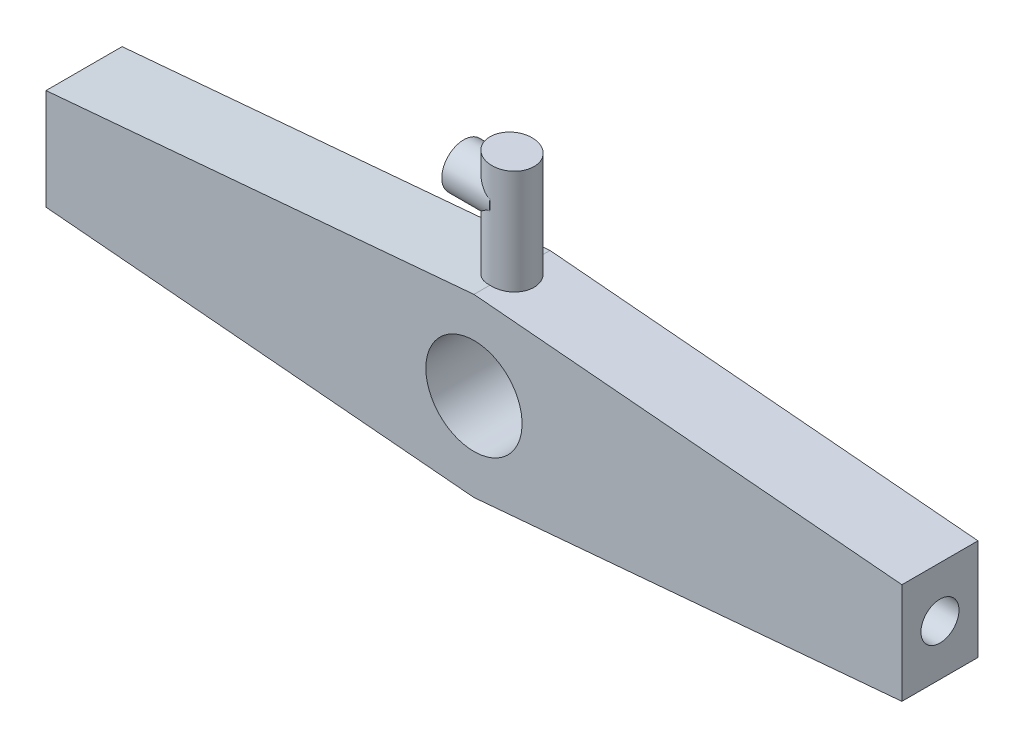
ISO-10303-21;
HEADER;
FILE_DESCRIPTION(('STEP AP214'),'2;1');
FILE_NAME('part.step','',(''),(''),'','','');
FILE_SCHEMA(('AUTOMOTIVE_DESIGN { 1 0 10303 214 1 1 1 1 }'));
ENDSEC;
DATA;
#1=APPLICATION_CONTEXT('core data for automotive mechanical design processes');
#2=APPLICATION_PROTOCOL_DEFINITION('international standard','automotive_design',2000,#1);
#3=PRODUCT_CONTEXT('',#1,'mechanical');
#4=PRODUCT('Part','Part','',(#3));
#5=PRODUCT_RELATED_PRODUCT_CATEGORY('part','',(#4));
#6=PRODUCT_DEFINITION_FORMATION('','',#4);
#7=PRODUCT_DEFINITION_CONTEXT('part definition',#1,'design');
#8=PRODUCT_DEFINITION('design','',#6,#7);
#9=PRODUCT_DEFINITION_SHAPE('','',#8);
#10=(LENGTH_UNIT() NAMED_UNIT(*) SI_UNIT(.MILLI.,.METRE.));
#11=(NAMED_UNIT(*) PLANE_ANGLE_UNIT() SI_UNIT($,.RADIAN.));
#12=(NAMED_UNIT(*) SI_UNIT($,.STERADIAN.) SOLID_ANGLE_UNIT());
#13=UNCERTAINTY_MEASURE_WITH_UNIT(LENGTH_MEASURE(1.E-05),#10,'distance_accuracy_value','');
#14=(GEOMETRIC_REPRESENTATION_CONTEXT(3) GLOBAL_UNCERTAINTY_ASSIGNED_CONTEXT((#13)) GLOBAL_UNIT_ASSIGNED_CONTEXT((#10,
#11,#12)) REPRESENTATION_CONTEXT('',''));
#15=CARTESIAN_POINT('',(0.,0.,0.));
#16=DIRECTION('',(0.,0.,1.));
#17=DIRECTION('',(1.,0.,0.));
#18=AXIS2_PLACEMENT_3D('',#15,#16,#17);
#19=CARTESIAN_POINT('',(0.,-23.4932723213508,20.32));
#20=DIRECTION('',(-0.0871557427476577,0.996194698091746,0.));
#21=DIRECTION('',(-0.996194698091746,-0.0871557427476577,0.));
#22=AXIS2_PLACEMENT_3D('',#19,#20,#21);
#23=PLANE('',#22);
#24=DIRECTION('',(0.,0.,-1.));
#25=VECTOR('',#24,1.);
#26=CARTESIAN_POINT('',(114.3,-13.4933180803377,20.32));
#27=LINE('',#26,#25);
#28=CARTESIAN_POINT('',(114.3,-13.4933180803377,20.32));
#29=VERTEX_POINT('',#28);
#30=CARTESIAN_POINT('',(114.3,-13.4933180803377,0.));
#31=VERTEX_POINT('',#30);
#32=EDGE_CURVE('E53',#29,#31,#27,.T.);
#33=ORIENTED_EDGE('',*,*,#32,.F.);
#34=DIRECTION('',(0.996194698091746,0.0871557427476577,0.));
#35=VECTOR('',#34,1.);
#36=CARTESIAN_POINT('',(0.,-23.4932723213508,20.32));
#37=LINE('',#36,#35);
#38=CARTESIAN_POINT('',(0.,-23.4932723213508,20.32));
#39=VERTEX_POINT('',#38);
#40=EDGE_CURVE('E233',#39,#29,#37,.T.);
#41=ORIENTED_EDGE('',*,*,#40,.F.);
#42=DIRECTION('',(0.,0.,-1.));
#43=VECTOR('',#42,1.);
#44=CARTESIAN_POINT('',(0.,-23.4932723213508,20.32));
#45=LINE('',#44,#43);
#46=CARTESIAN_POINT('',(0.,-23.4932723213508,0.));
#47=VERTEX_POINT('',#46);
#48=EDGE_CURVE('E137',#39,#47,#45,.T.);
#49=ORIENTED_EDGE('',*,*,#48,.T.);
#50=DIRECTION('',(0.996194698091746,0.0871557427476577,0.));
#51=VECTOR('',#50,1.);
#52=CARTESIAN_POINT('',(0.,-23.4932723213508,0.));
#53=LINE('',#52,#51);
#54=EDGE_CURVE('E123',#47,#31,#53,.T.);
#55=ORIENTED_EDGE('',*,*,#54,.T.);
#56=EDGE_LOOP('',(#33,#41,#49,#55));
#57=FACE_BOUND('',#56,.T.);
#58=ADVANCED_FACE('F39',(#57),#23,.F.);
#59=CARTESIAN_POINT('',(152.4,10.1600000000002,20.32));
#60=DIRECTION('',(-0.0871557427476576,-0.996194698091746,0.));
#61=DIRECTION('',(0.996194698091746,-0.0871557427476576,0.));
#62=AXIS2_PLACEMENT_3D('',#59,#60,#61);
#63=PLANE('',#62);
#64=DIRECTION('',(0.,0.,1.));
#65=VECTOR('',#64,1.);
#66=CARTESIAN_POINT('',(114.3,13.4933180803379,20.32));
#67=LINE('',#66,#65);
#68=CARTESIAN_POINT('',(114.3,13.4933180803379,0.));
#69=VERTEX_POINT('',#68);
#70=CARTESIAN_POINT('',(114.3,13.4933180803379,20.32));
#71=VERTEX_POINT('',#70);
#72=EDGE_CURVE('E200',#69,#71,#67,.T.);
#73=ORIENTED_EDGE('',*,*,#72,.F.);
#74=DIRECTION('',(-0.996194698091746,0.0871557427476576,0.));
#75=VECTOR('',#74,1.);
#76=CARTESIAN_POINT('',(152.4,10.1600000000002,0.));
#77=LINE('',#76,#75);
#78=CARTESIAN_POINT('',(0.,23.4932723213509,0.));
#79=VERTEX_POINT('',#78);
#80=EDGE_CURVE('E126',#69,#79,#77,.T.);
#81=ORIENTED_EDGE('',*,*,#80,.T.);
#82=DIRECTION('',(0.,0.,-1.));
#83=VECTOR('',#82,1.);
#84=CARTESIAN_POINT('',(0.,23.4932723213509,20.32));
#85=LINE('',#84,#83);
#86=CARTESIAN_POINT('',(0.,23.4932723213509,4.27700993086949));
#87=VERTEX_POINT('',#86);
#88=EDGE_CURVE('E138',#87,#79,#85,.T.);
#89=ORIENTED_EDGE('',*,*,#88,.F.);
#90=CARTESIAN_POINT('',(0.,23.4932723213509,10.16));
#91=DIRECTION('',(-0.0871557427476576,-0.996194698091746,0.));
#92=DIRECTION('',(-0.996194698091746,0.0871557427476576,0.));
#93=AXIS2_PLACEMENT_3D('',#90,#91,#92);
#94=ELLIPSE('',#93,5.90546213546372,5.88299006913051);
#95=CARTESIAN_POINT('',(0.,23.4932723213509,16.0429900691305));
#96=VERTEX_POINT('',#95);
#97=EDGE_CURVE('E140',#96,#87,#94,.F.);
#98=ORIENTED_EDGE('',*,*,#97,.F.);
#99=CARTESIAN_POINT('',(0.,23.4932723213509,20.32));
#100=VERTEX_POINT('',#99);
#101=EDGE_CURVE('E134',#100,#96,#85,.T.);
#102=ORIENTED_EDGE('',*,*,#101,.F.);
#103=DIRECTION('',(-0.996194698091746,0.0871557427476576,0.));
#104=VECTOR('',#103,1.);
#105=CARTESIAN_POINT('',(152.4,10.1600000000002,20.32));
#106=LINE('',#105,#104);
#107=EDGE_CURVE('E202',#71,#100,#106,.T.);
#108=ORIENTED_EDGE('',*,*,#107,.F.);
#109=EDGE_LOOP('',(#73,#81,#89,#98,#102,#108));
#110=FACE_BOUND('',#109,.T.);
#111=ADVANCED_FACE('F172',(#110),#63,.F.);
#112=CARTESIAN_POINT('',(0.,0.,20.32));
#113=DIRECTION('',(0.,0.,1.));
#114=DIRECTION('',(1.,0.,0.));
#115=AXIS2_PLACEMENT_3D('',#112,#113,#114);
#116=PLANE('',#115);
#117=CARTESIAN_POINT('',(0.,0.,20.32));
#118=DIRECTION('',(0.,0.,-1.));
#119=DIRECTION('',(-1.,0.,0.));
#120=AXIS2_PLACEMENT_3D('',#117,#118,#119);
#121=CIRCLE('',#120,12.85);
#122=CARTESIAN_POINT('',(-12.85,0.,20.32));
#123=VERTEX_POINT('',#122);
#124=EDGE_CURVE('E211',#123,#123,#121,.T.);
#125=ORIENTED_EDGE('',*,*,#124,.T.);
#126=EDGE_LOOP('',(#125));
#127=FACE_BOUND('',#126,.T.);
#128=ORIENTED_EDGE('',*,*,#40,.T.);
#129=DIRECTION('',(0.,1.,0.));
#130=VECTOR('',#129,1.);
#131=CARTESIAN_POINT('',(114.3,0.,20.32));
#132=LINE('',#131,#130);
#133=EDGE_CURVE('E204',#29,#71,#132,.T.);
#134=ORIENTED_EDGE('',*,*,#133,.T.);
#135=ORIENTED_EDGE('',*,*,#107,.T.);
#136=DIRECTION('',(-0.996194698091745,-0.0871557427476594,0.));
#137=VECTOR('',#136,1.);
#138=CARTESIAN_POINT('',(0.,23.4932723213509,20.32));
#139=LINE('',#138,#137);
#140=CARTESIAN_POINT('',(-114.3,13.4933180803377,20.32));
#141=VERTEX_POINT('',#140);
#142=EDGE_CURVE('E133',#100,#141,#139,.T.);
#143=ORIENTED_EDGE('',*,*,#142,.T.);
#144=DIRECTION('',(0.,1.,0.));
#145=VECTOR('',#144,1.);
#146=CARTESIAN_POINT('',(-114.3,0.,20.32));
#147=LINE('',#146,#145);
#148=CARTESIAN_POINT('',(-114.3,-13.4933180803378,20.32));
#149=VERTEX_POINT('',#148);
#150=EDGE_CURVE('E109',#149,#141,#147,.T.);
#151=ORIENTED_EDGE('',*,*,#150,.F.);
#152=DIRECTION('',(0.996194698091746,-0.0871557427476576,0.));
#153=VECTOR('',#152,1.);
#154=CARTESIAN_POINT('',(-152.4,-10.1600000000001,20.32));
#155=LINE('',#154,#153);
#156=EDGE_CURVE('E118',#149,#39,#155,.T.);
#157=ORIENTED_EDGE('',*,*,#156,.T.);
#158=EDGE_LOOP('',(#128,#134,#135,#143,#151,#157));
#159=FACE_BOUND('',#158,.T.);
#160=ADVANCED_FACE('F179',(#127,#159),#116,.T.);
#161=CARTESIAN_POINT('',(0.,0.,0.));
#162=DIRECTION('',(0.,0.,1.));
#163=DIRECTION('',(1.,0.,0.));
#164=AXIS2_PLACEMENT_3D('',#161,#162,#163);
#165=PLANE('',#164);
#166=CARTESIAN_POINT('',(0.,0.,0.));
#167=DIRECTION('',(0.,0.,-1.));
#168=DIRECTION('',(-1.,0.,0.));
#169=AXIS2_PLACEMENT_3D('',#166,#167,#168);
#170=CIRCLE('',#169,12.85);
#171=CARTESIAN_POINT('',(-12.85,0.,0.));
#172=VERTEX_POINT('',#171);
#173=EDGE_CURVE('E206',#172,#172,#170,.T.);
#174=ORIENTED_EDGE('',*,*,#173,.F.);
#175=EDGE_LOOP('',(#174));
#176=FACE_BOUND('',#175,.T.);
#177=DIRECTION('',(0.,1.,0.));
#178=VECTOR('',#177,1.);
#179=CARTESIAN_POINT('',(114.3,0.,0.));
#180=LINE('',#179,#178);
#181=EDGE_CURVE('E11',#31,#69,#180,.T.);
#182=ORIENTED_EDGE('',*,*,#181,.F.);
#183=ORIENTED_EDGE('',*,*,#54,.F.);
#184=DIRECTION('',(0.996194698091746,-0.0871557427476576,0.));
#185=VECTOR('',#184,1.);
#186=CARTESIAN_POINT('',(-152.4,-10.1600000000001,0.));
#187=LINE('',#186,#185);
#188=CARTESIAN_POINT('',(-114.3,-13.4933180803378,0.));
#189=VERTEX_POINT('',#188);
#190=EDGE_CURVE('E116',#189,#47,#187,.T.);
#191=ORIENTED_EDGE('',*,*,#190,.F.);
#192=DIRECTION('',(0.,-1.,0.));
#193=VECTOR('',#192,1.);
#194=CARTESIAN_POINT('',(-114.3,0.,0.));
#195=LINE('',#194,#193);
#196=CARTESIAN_POINT('',(-114.3,13.4933180803377,0.));
#197=VERTEX_POINT('',#196);
#198=EDGE_CURVE('E100',#197,#189,#195,.T.);
#199=ORIENTED_EDGE('',*,*,#198,.F.);
#200=DIRECTION('',(-0.996194698091745,-0.0871557427476594,0.));
#201=VECTOR('',#200,1.);
#202=CARTESIAN_POINT('',(0.,23.4932723213509,0.));
#203=LINE('',#202,#201);
#204=EDGE_CURVE('E124',#79,#197,#203,.T.);
#205=ORIENTED_EDGE('',*,*,#204,.F.);
#206=ORIENTED_EDGE('',*,*,#80,.F.);
#207=EDGE_LOOP('',(#182,#183,#191,#199,#205,#206));
#208=FACE_BOUND('',#207,.T.);
#209=ADVANCED_FACE('F121',(#176,#208),#165,.F.);
#210=CARTESIAN_POINT('',(0.,23.4932723213509,20.32));
#211=DIRECTION('',(0.0871557427476594,-0.996194698091745,0.));
#212=DIRECTION('',(0.996194698091746,0.0871557427476594,0.));
#213=AXIS2_PLACEMENT_3D('',#210,#211,#212);
#214=PLANE('',#213);
#215=ORIENTED_EDGE('',*,*,#204,.T.);
#216=DIRECTION('',(0.,0.,1.));
#217=VECTOR('',#216,1.);
#218=CARTESIAN_POINT('',(-114.3,13.4933180803377,20.32));
#219=LINE('',#218,#217);
#220=EDGE_CURVE('E61',#197,#141,#219,.T.);
#221=ORIENTED_EDGE('',*,*,#220,.T.);
#222=ORIENTED_EDGE('',*,*,#142,.F.);
#223=ORIENTED_EDGE('',*,*,#101,.T.);
#224=CARTESIAN_POINT('',(0.,23.4932723213509,10.16));
#225=DIRECTION('',(0.0871557427476594,-0.996194698091745,0.));
#226=DIRECTION('',(0.996194698091745,0.0871557427476594,0.));
#227=AXIS2_PLACEMENT_3D('',#224,#225,#226);
#228=ELLIPSE('',#227,5.90546213546372,5.88299006913051);
#229=EDGE_CURVE('E128',#87,#96,#228,.F.);
#230=ORIENTED_EDGE('',*,*,#229,.F.);
#231=ORIENTED_EDGE('',*,*,#88,.T.);
#232=EDGE_LOOP('',(#215,#221,#222,#223,#230,#231));
#233=FACE_BOUND('',#232,.T.);
#234=ADVANCED_FACE('F41',(#233),#214,.F.);
#235=CARTESIAN_POINT('',(-152.4,-10.1600000000001,20.32));
#236=DIRECTION('',(0.0871557427476576,0.996194698091746,0.));
#237=DIRECTION('',(-0.996194698091746,0.0871557427476576,0.));
#238=AXIS2_PLACEMENT_3D('',#235,#236,#237);
#239=PLANE('',#238);
#240=ORIENTED_EDGE('',*,*,#156,.F.);
#241=DIRECTION('',(0.,0.,-1.));
#242=VECTOR('',#241,1.);
#243=CARTESIAN_POINT('',(-114.3,-13.4933180803378,20.32));
#244=LINE('',#243,#242);
#245=EDGE_CURVE('E103',#149,#189,#244,.T.);
#246=ORIENTED_EDGE('',*,*,#245,.T.);
#247=ORIENTED_EDGE('',*,*,#190,.T.);
#248=ORIENTED_EDGE('',*,*,#48,.F.);
#249=EDGE_LOOP('',(#240,#246,#247,#248));
#250=FACE_BOUND('',#249,.T.);
#251=ADVANCED_FACE('F114',(#250),#239,.F.);
#252=CARTESIAN_POINT('',(0.,15.3585773828179,10.16));
#253=DIRECTION('',(0.,1.,0.));
#254=DIRECTION('',(0.,0.,1.));
#255=AXIS2_PLACEMENT_3D('',#252,#253,#254);
#256=CYLINDRICAL_SURFACE('',#255,5.88299006913051);
#257=DIRECTION('',(0.,1.,0.));
#258=VECTOR('',#257,1.);
#259=CARTESIAN_POINT('',(0.,15.3585773828179,16.0429900691305));
#260=LINE('',#259,#258);
#261=CARTESIAN_POINT('',(0.,43.4667345390869,16.0429900691305));
#262=VERTEX_POINT('',#261);
#263=CARTESIAN_POINT('',(0.,40.5969888718145,16.0429900691305));
#264=VERTEX_POINT('',#263);
#265=EDGE_CURVE('E143',#262,#264,#260,.F.);
#266=ORIENTED_EDGE('',*,*,#265,.T.);
#267=CARTESIAN_POINT('',(0.,40.5969888718145,16.0429900691305));
#268=CARTESIAN_POINT('',(-0.0507233716180359,40.5970423621136,16.0429968325928));
#269=CARTESIAN_POINT('',(-0.101391923464873,40.5943730206743,16.0423339817998));
#270=CARTESIAN_POINT('',(-0.202031503958911,40.584052004848,16.0397331403268));
#271=CARTESIAN_POINT('',(-0.252004225975632,40.5764160371644,16.0377991692981));
#272=CARTESIAN_POINT('',(-0.398452063028152,40.5471274660646,16.0302837291207));
#273=CARTESIAN_POINT('',(-0.493564026932945,40.5190555631602,16.0229829456634));
#274=CARTESIAN_POINT('',(-0.663952634257977,40.4563351286083,16.0059301905964));
#275=CARTESIAN_POINT('',(-0.739980994383311,40.423438347139,15.9967514146317));
#276=CARTESIAN_POINT('',(-0.888886875985811,40.3517350256114,15.9759340289191));
#277=CARTESIAN_POINT('',(-0.961761783974112,40.3129236997932,15.9642934241951));
#278=CARTESIAN_POINT('',(-1.1781250031672,40.1895376152284,15.9257025476162));
#279=CARTESIAN_POINT('',(-1.31743962289615,40.0988264371081,15.8952884993961));
#280=CARTESIAN_POINT('',(-1.61589828195137,39.8909991335202,15.8192100741218));
#281=CARTESIAN_POINT('',(-1.77337824863868,39.772246387878,15.7717073700156));
#282=CARTESIAN_POINT('',(-2.08107432425158,39.5304204295999,15.6650135439132));
#283=CARTESIAN_POINT('',(-2.23128372927519,39.407343403588,15.6058118810668));
#284=CARTESIAN_POINT('',(-2.52521504409887,39.1606577800189,15.475879827428));
#285=CARTESIAN_POINT('',(-2.66895690815311,39.0370523214614,15.4051885197508));
#286=CARTESIAN_POINT('',(-2.95088134310323,38.790999225875,15.2519148788382));
#287=CARTESIAN_POINT('',(-3.08906596557627,38.6685511745746,15.1693369863206));
#288=CARTESIAN_POINT('',(-3.36304889577832,38.4234324185181,14.9897949138531));
#289=CARTESIAN_POINT('',(-3.49871240984866,38.3008256028067,14.892535435426));
#290=CARTESIAN_POINT('',(-3.76355922260491,38.0599455563261,14.6847697534928));
#291=CARTESIAN_POINT('',(-3.89274117658643,37.9416732261768,14.5742608171599));
#292=CARTESIAN_POINT('',(-4.26909474414113,37.5957747640874,14.222301482823));
#293=CARTESIAN_POINT('',(-4.50556223266685,37.3766248529639,13.9601056434007));
#294=CARTESIAN_POINT('',(-4.87697182359837,37.0322664308457,13.4603713132613));
#295=CARTESIAN_POINT('',(-5.02179407459334,36.8979430481215,13.2365161467421));
#296=CARTESIAN_POINT('',(-5.21842880289069,36.7162373433147,12.8795652443417));
#297=CARTESIAN_POINT('',(-5.28052903452697,36.6589759171929,12.7570832977667));
#298=CARTESIAN_POINT('',(-5.39704526195014,36.5519250122942,12.505354942969));
#299=CARTESIAN_POINT('',(-5.4514624988198,36.5021343266395,12.3761096319093));
#300=CARTESIAN_POINT('',(-5.5437313319438,36.4182289519886,12.1325064820594));
#301=CARTESIAN_POINT('',(-5.58284116078685,36.3828805340577,12.0190483500804));
#302=CARTESIAN_POINT('',(-5.65445578167218,36.31869385012,11.7882781393238));
#303=CARTESIAN_POINT('',(-5.68696183376217,36.28985434205,11.6709668007373));
#304=CARTESIAN_POINT('',(-5.74488310333297,36.2391913951261,11.4331326863397));
#305=CARTESIAN_POINT('',(-5.77029942511326,36.2173668635358,11.3126104138725));
#306=CARTESIAN_POINT('',(-5.81362788908437,36.181164048808,11.0691646945259));
#307=CARTESIAN_POINT('',(-5.83154303312915,36.1667827864456,10.9462422288178));
#308=CARTESIAN_POINT('',(-5.85964023794123,36.1457269963405,10.698341700248));
#309=CARTESIAN_POINT('',(-5.86979025973268,36.1390843399136,10.5733572714882));
#310=CARTESIAN_POINT('',(-5.88207357675243,36.1337892785626,10.3228241085184));
#311=CARTESIAN_POINT('',(-5.88420686092181,36.1351368846609,10.1972753735301));
#312=CARTESIAN_POINT('',(-5.88045565225516,36.145837494593,9.94664348849559));
#313=CARTESIAN_POINT('',(-5.87457127770124,36.1551903803265,9.8215603316082));
#314=CARTESIAN_POINT('',(-5.85494677887039,36.1817539077916,9.57286159257143));
#315=CARTESIAN_POINT('',(-5.84120682212943,36.198964381943,9.44924597918115));
#316=CARTESIAN_POINT('',(-5.80724505484495,36.2396725784171,9.21186445278678));
#317=CARTESIAN_POINT('',(-5.78746937874391,36.2627231342368,9.09795743511897));
#318=CARTESIAN_POINT('',(-5.74161431571017,36.31515792811,8.8728899947917));
#319=CARTESIAN_POINT('',(-5.71553256498495,36.3445445407466,8.76173061933127));
#320=CARTESIAN_POINT('',(-5.6284133467418,36.4416472596434,8.43322762255529));
#321=CARTESIAN_POINT('',(-5.55848632094275,36.5183247725582,8.22075384634682));
#322=CARTESIAN_POINT('',(-5.424232467805,36.6642012527176,7.87752329355235));
#323=CARTESIAN_POINT('',(-5.36519802334014,36.7280223943787,7.7422693827547));
#324=CARTESIAN_POINT('',(-5.23906217055595,36.8639472931535,7.47989241406409));
#325=CARTESIAN_POINT('',(-5.17195835454813,36.9360535220327,7.35277180035319));
#326=CARTESIAN_POINT('',(-4.96014036436632,37.1633091320018,6.98400780582283));
#327=CARTESIAN_POINT('',(-4.80491865143198,37.3293965135329,6.7549598113393));
#328=CARTESIAN_POINT('',(-4.52726103873885,37.6269343111416,6.39873588871943));
#329=CARTESIAN_POINT('',(-4.41008807695949,37.7526122753949,6.26232170365273));
#330=CARTESIAN_POINT('',(-4.16839818734098,38.0125991937273,6.00486127420554));
#331=CARTESIAN_POINT('',(-4.04387744721653,38.1469126314879,5.8838231119627));
#332=CARTESIAN_POINT('',(-3.78867504197607,38.4236024410842,5.65611929953271));
#333=CARTESIAN_POINT('',(-3.6579620173619,38.566020804557,5.54954046367934));
#334=CARTESIAN_POINT('',(-3.39285822117496,38.857274243272,5.35110591644349));
#335=CARTESIAN_POINT('',(-3.2584700985819,39.0061047390251,5.25923991143736));
#336=CARTESIAN_POINT('',(-2.98270618407666,39.315613569992,5.08649103118043));
#337=CARTESIAN_POINT('',(-2.84125715951128,39.4765268661524,5.00614817644085));
#338=CARTESIAN_POINT('',(-2.55847156975472,39.8057912126942,4.86008609349229));
#339=CARTESIAN_POINT('',(-2.41713617317662,39.9741598793104,4.7944039889226));
#340=CARTESIAN_POINT('',(-2.2096492674901,40.2325790640803,4.70723855729539));
#341=CARTESIAN_POINT('',(-2.14157677549741,40.3192381982198,4.68018635067822));
#342=CARTESIAN_POINT('',(-2.00767402380585,40.4952945367165,4.6297270707836));
#343=CARTESIAN_POINT('',(-1.94184313854377,40.5846909637319,4.60631897392521));
#344=CARTESIAN_POINT('',(-1.81420353146993,40.7666320495026,4.56332667660167));
#345=CARTESIAN_POINT('',(-1.75237898401396,40.8591618031699,4.54372673056773));
#346=CARTESIAN_POINT('',(-1.63506621611166,41.0488239579763,4.50846497637913));
#347=CARTESIAN_POINT('',(-1.57956803640884,41.145948774438,4.49279693038232));
#348=CARTESIAN_POINT('',(-1.50925779992352,41.286807776329,4.47386188168772));
#349=CARTESIAN_POINT('',(-1.48985778112067,41.3279921710724,4.46875637823653));
#350=CARTESIAN_POINT('',(-1.45334697137278,41.4114536617959,4.45932392411295));
#351=CARTESIAN_POINT('',(-1.43623669011087,41.4537309985683,4.45499714670706));
#352=CARTESIAN_POINT('',(-1.38926761077901,41.5819822429106,4.44330978730189));
#353=CARTESIAN_POINT('',(-1.36358489820217,41.6697279669245,4.43719356999038));
#354=CARTESIAN_POINT('',(-1.33104363637954,41.8351090877963,4.42954198269835));
#355=CARTESIAN_POINT('',(-1.32191775615206,41.9122548315532,4.4274517734369));
#356=CARTESIAN_POINT('',(-1.31710816899411,42.066991594904,4.42634437442759));
#357=CARTESIAN_POINT('',(-1.32142011013454,42.1445824622178,4.42732618978423));
#358=CARTESIAN_POINT('',(-1.34517902717999,42.3165749950311,4.4328509538193));
#359=CARTESIAN_POINT('',(-1.36806507692523,42.4104544511218,4.43820503763595));
#360=CARTESIAN_POINT('',(-1.42781848307571,42.5934787614446,4.45282635160174));
#361=CARTESIAN_POINT('',(-1.46475231944691,42.6825987687859,4.46211221258842));
#362=CARTESIAN_POINT('',(-1.56422627196585,42.8916521214135,4.48846124729151));
#363=CARTESIAN_POINT('',(-1.63105970061278,43.0092679335103,4.5071520451982));
#364=CARTESIAN_POINT('',(-1.77363613556692,43.2379788180072,4.55024012164015));
#365=CARTESIAN_POINT('',(-1.84940087778023,43.3490569531752,4.57465147080314));
#366=CARTESIAN_POINT('',(-2.00612773877566,43.5671336086613,4.62900074527438));
#367=CARTESIAN_POINT('',(-2.08711924811232,43.6741024639265,4.65897209419445));
#368=CARTESIAN_POINT('',(-2.25152279520796,43.8842843714928,4.72418769413649));
#369=CARTESIAN_POINT('',(-2.33493228813688,43.9875011319658,4.75942655288889));
#370=CARTESIAN_POINT('',(-2.5800530232912,44.2845395199999,4.87000304164191));
#371=CARTESIAN_POINT('',(-2.74330872190536,44.4744932215616,4.95243979602959));
#372=CARTESIAN_POINT('',(-3.06872193369726,44.8457134377709,5.13728217570191));
#373=CARTESIAN_POINT('',(-3.2308783182755,45.0269719282561,5.23970581996004));
#374=CARTESIAN_POINT('',(-3.55000744288022,45.3797289228041,5.46479223442641));
#375=CARTESIAN_POINT('',(-3.70699897525217,45.5512649660919,5.58736884698618));
#376=CARTESIAN_POINT('',(-4.01341091237925,45.8839868615806,5.85380466697012));
#377=CARTESIAN_POINT('',(-4.16283726094912,46.0451808667903,5.99764680687697));
#378=CARTESIAN_POINT('',(-4.48987365102138,46.3968822015722,6.34914222261942));
#379=CARTESIAN_POINT('',(-4.66432191563779,46.5836870304385,6.56357000523036));
#380=CARTESIAN_POINT('',(-4.98872092556458,46.9311163450738,7.02909376457006));
#381=CARTESIAN_POINT('',(-5.13869934137678,47.0917704016484,7.28014770707454));
#382=CARTESIAN_POINT('',(-5.3799184588537,47.3514729597378,7.76725983691099));
#383=CARTESIAN_POINT('',(-5.47690163873937,47.4564254621182,7.99724242619016));
#384=CARTESIAN_POINT('',(-5.60144128614788,47.5926451802963,8.35733006031837));
#385=CARTESIAN_POINT('',(-5.63947257369773,47.6345251504319,8.47991251766919));
#386=CARTESIAN_POINT('',(-5.70788553855376,47.7105721635063,8.72950031758059));
#387=CARTESIAN_POINT('',(-5.73827067098352,47.7447426894431,8.85650363281558));
#388=CARTESIAN_POINT('',(-5.79097981796428,47.8050137936291,9.11516229772274));
#389=CARTESIAN_POINT('',(-5.81323809054245,47.8310483225941,9.24684652256461));
#390=CARTESIAN_POINT('',(-5.84882924747719,47.8741743005888,9.51287336878235));
#391=CARTESIAN_POINT('',(-5.86216209410272,47.8912657118127,9.64721600139381));
#392=CARTESIAN_POINT('',(-5.87953814523993,47.9161585355789,9.91729466731894));
#393=CARTESIAN_POINT('',(-5.88358580223742,47.9239643999134,10.0530300014172));
#394=CARTESIAN_POINT('',(-5.88225289632356,47.9301672944258,10.3246617175148));
#395=CARTESIAN_POINT('',(-5.87687331237839,47.9285653015164,10.4605580813276));
#396=CARTESIAN_POINT('',(-5.85800158863677,47.9168198352092,10.71458794574));
#397=CARTESIAN_POINT('',(-5.84558635321002,47.9077489959572,10.8328541597074));
#398=CARTESIAN_POINT('',(-5.81374675790853,47.8826412446159,11.0677280176565));
#399=CARTESIAN_POINT('',(-5.79432013362675,47.8666020816865,11.1843351131464));
#400=CARTESIAN_POINT('',(-5.7487566374523,47.8278686083837,11.4150655263363));
#401=CARTESIAN_POINT('',(-5.72262182382138,47.8051763390679,11.5291895942686));
#402=CARTESIAN_POINT('',(-5.66401956839212,47.7535316817989,11.7543701635552));
#403=CARTESIAN_POINT('',(-5.63154960947635,47.7245768050515,11.8654254255042));
#404=CARTESIAN_POINT('',(-5.52316033646714,47.6270787632458,12.1996238388517));
#405=CARTESIAN_POINT('',(-5.43762236007978,47.5490665727382,12.4170201311677));
#406=CARTESIAN_POINT('',(-5.2456093790398,47.3726768474714,12.8331774711231));
#407=CARTESIAN_POINT('',(-5.13912648188392,47.2742916349733,13.0319314521084));
#408=CARTESIAN_POINT('',(-4.8481746204558,47.0048693921395,13.509453179281));
#409=CARTESIAN_POINT('',(-4.65218906933634,46.8228771511668,13.7751556255675));
#410=CARTESIAN_POINT('',(-4.33643605214775,46.5306752904564,14.1388048605804));
#411=CARTESIAN_POINT('',(-4.22731786445098,46.4298533585496,14.2543981402352));
#412=CARTESIAN_POINT('',(-4.00270440461936,46.2230001232923,14.4742296950827));
#413=CARTESIAN_POINT('',(-3.88720966888439,46.1169692582035,14.5784689232));
#414=CARTESIAN_POINT('',(-3.60979354442035,45.8635791666213,14.8099425959378));
#415=CARTESIAN_POINT('',(-3.44561323541104,45.7145929971163,14.9326863876374));
#416=CARTESIAN_POINT('',(-3.10828749233929,45.4120505314004,15.1589395716397));
#417=CARTESIAN_POINT('',(-2.93513575938296,45.2584910573085,15.2624352091485));
#418=CARTESIAN_POINT('',(-2.58051502844263,44.950150964496,15.4506338698979));
#419=CARTESIAN_POINT('',(-2.3990610857547,44.7953729471049,15.5353694008875));
#420=CARTESIAN_POINT('',(-2.11959012164647,44.5656108742336,15.6488044852018));
#421=CARTESIAN_POINT('',(-2.02525532346271,44.4894528014559,15.6843272483692));
#422=CARTESIAN_POINT('',(-1.83367651191681,44.3388475748181,15.7508395842799));
#423=CARTESIAN_POINT('',(-1.73643306585023,44.2644000922728,15.7818300341394));
#424=CARTESIAN_POINT('',(-1.51478505607417,44.1011850702761,15.8460648519918));
#425=CARTESIAN_POINT('',(-1.38942478400133,44.0132267798731,15.8780899812577));
#426=CARTESIAN_POINT('',(-1.13091925512351,43.8464122953749,15.9347840946767));
#427=CARTESIAN_POINT('',(-0.997775725822112,43.7675540929728,15.9594547038157));
#428=CARTESIAN_POINT('',(-0.76564892762473,43.6512669159574,15.9937184605735));
#429=CARTESIAN_POINT('',(-0.669644254450422,43.6087061097016,16.0056056293766));
#430=CARTESIAN_POINT('',(-0.472332269563143,43.5377469686684,16.0248247394411));
#431=CARTESIAN_POINT('',(-0.371058990514805,43.5092678215632,16.0321827340169));
#432=CARTESIAN_POINT('',(-0.223846169929874,43.4829788781484,16.0388960602531));
#433=CARTESIAN_POINT('',(-0.179444674061833,43.47694585766,16.0404211219199));
#434=CARTESIAN_POINT('',(-0.0900416393279649,43.4687984369002,16.0424724793664));
#435=CARTESIAN_POINT('',(-0.0450382148761371,43.4667036644325,16.0429937727834));
#436=CARTESIAN_POINT('',(0.,43.4667345390869,16.0429900691305));
#437=B_SPLINE_CURVE_WITH_KNOTS('',3,(#267,#268,#269,#270,#271,#272,#273,#274,#275,#276,#277,
#278,#279,#280,#281,#282,#283,#284,#285,#286,#287,#288,#289,#290,#291,#292,#293,#294,#295,#296,
#297,#298,#299,#300,#301,#302,#303,#304,#305,#306,#307,#308,#309,#310,#311,#312,#313,#314,#315,
#316,#317,#318,#319,#320,#321,#322,#323,#324,#325,#326,#327,#328,#329,#330,#331,#332,#333,#334,
#335,#336,#337,#338,#339,#340,#341,#342,#343,#344,#345,#346,#347,#348,#349,#350,#351,#352,#353,
#354,#355,#356,#357,#358,#359,#360,#361,#362,#363,#364,#365,#366,#367,#368,#369,#370,#371,#372,
#373,#374,#375,#376,#377,#378,#379,#380,#381,#382,#383,#384,#385,#386,#387,#388,#389,#390,#391,
#392,#393,#394,#395,#396,#397,#398,#399,#400,#401,#402,#403,#404,#405,#406,#407,#408,#409,#410,
#411,#412,#413,#414,#415,#416,#417,#418,#419,#420,#421,#422,#423,#424,#425,#426,#427,#428,#429,
#430,#431,#432,#433,#434,#435,#436),.UNSPECIFIED.,.F.,.F.,(4,2,2,2,2,2,2,2,2,2,2,2,2,2,2,2,2,2,
2,2,2,2,2,2,2,2,2,2,2,2,2,2,2,2,2,2,2,2,2,2,2,2,2,2,2,2,2,2,2,2,2,2,2,2,2,2,2,2,2,2,2,2,2,2,2,2,
2,2,2,2,2,2,2,2,2,2,2,2,2,2,2,2,2,2,4),(0.,0.152003119513495,0.303527858897819,
0.600364771393059,0.850073946034549,1.09998625660405,1.60602134129898,2.21406726233968,
2.82266355601143,3.42923138800736,4.03557319721764,4.65632740342317,5.2772098670676,
6.51680864166865,7.40900308364877,7.85490120116832,8.30072720733037,8.67567769368779,
9.0505565694838,9.42537702133552,9.80004733221264,10.176255321455,10.5524638296675,
10.9286667878481,11.3048617230488,11.6581265229322,12.0115239477659,12.7179981381011,
13.1997781834363,13.6817023376331,14.6455421598124,15.3029951743415,15.9607923500988,
16.6223789761354,17.2835006911159,17.9693762328853,18.6569693132504,18.9972991841113,
19.3375332877805,19.6763292027916,20.0145841810292,20.1519446583318,20.2893356606512,
20.562921278414,20.7949359974906,21.0268755848448,21.3154590045669,21.605425464561,
22.0140715523114,22.4237335218365,22.8359430197055,23.2477333987323,24.0377968106632,
24.8285758144928,25.6160580399613,26.4029116364861,27.4003781157131,28.3967087230425,
29.2054590014786,29.6100473764048,30.0144525974108,30.4220603275838,30.8296697808531,
31.2370837340738,31.6444553821438,32.0018208250744,32.3593017866318,32.7166731937888,
33.0741868840976,33.8100215569335,34.5461340413712,35.670364271101,36.2347213826132,
36.7990310921122,37.5582227445501,38.3179548505891,39.0763599964151,39.4552749507877,
39.8341164783119,40.3031298127994,40.7720394415474,41.0883978592176,41.4029190433052,
41.5372541789915,41.6722570697053),.UNSPECIFIED.);
#438=EDGE_CURVE('E47',#264,#262,#437,.T.);
#439=ORIENTED_EDGE('',*,*,#438,.T.);
#440=EDGE_LOOP('',(#266,#439));
#441=FACE_BOUND('',#440,.T.);
#442=CARTESIAN_POINT('',(5.88299006913051,50.9185773828179,10.16));
#443=CARTESIAN_POINT('',(5.88299006913051,50.9185773828179,21.925980138261));
#444=CARTESIAN_POINT('',(-5.88299006913051,51.947967260187,21.925980138261));
#445=CARTESIAN_POINT('',(-5.88299006913051,51.9479672601869,10.16));
#446=CARTESIAN_POINT('',(-5.88299006913052,51.947967260187,-1.60598013826102));
#447=CARTESIAN_POINT('',(5.88299006913051,50.9185773828179,-1.60598013826102));
#448=CARTESIAN_POINT('',(5.88299006913051,50.9185773828179,10.16));
#449=(BOUNDED_CURVE() B_SPLINE_CURVE(3,(#442,#443,#444,#445,#446,#447,#448),.UNSPECIFIED.,.T.,
.F.) B_SPLINE_CURVE_WITH_KNOTS((4,3,4),(0.,0.5,1.),
.UNSPECIFIED.) CURVE() GEOMETRIC_REPRESENTATION_ITEM() RATIONAL_B_SPLINE_CURVE((1.,
0.333333333333333,0.333333333333333,1.,0.333333333333333,0.333333333333333,1.)) REPRESENTATION_ITEM(''));
#450=CARTESIAN_POINT('',(5.88299006913051,50.9185773828179,10.16));
#451=VERTEX_POINT('',#450);
#452=EDGE_CURVE('E220',#451,#451,#449,.T.);
#453=ORIENTED_EDGE('',*,*,#452,.T.);
#454=EDGE_LOOP('',(#453));
#455=FACE_BOUND('',#454,.T.);
#456=ORIENTED_EDGE('',*,*,#97,.T.);
#457=ORIENTED_EDGE('',*,*,#229,.T.);
#458=EDGE_LOOP('',(#456,#457));
#459=FACE_BOUND('',#458,.T.);
#460=ADVANCED_FACE('F152',(#441,#455,#459),#256,.T.);
#461=CARTESIAN_POINT('',(-5.88299006913051,51.9479672601869,10.16));
#462=DIRECTION('',(0.0871557427476575,0.996194698091746,0.));
#463=DIRECTION('',(-0.996194698091746,0.0871557427476576,0.));
#464=AXIS2_PLACEMENT_3D('',#461,#462,#463);
#465=PLANE('',#464);
#466=ORIENTED_EDGE('',*,*,#452,.F.);
#467=EDGE_LOOP('',(#466));
#468=FACE_BOUND('',#467,.T.);
#469=ADVANCED_FACE('F161',(#468),#465,.T.);
#470=CARTESIAN_POINT('',(-12.7,42.0318617054507,10.3234883065522));
#471=DIRECTION('',(1.,0.,0.));
#472=DIRECTION('',(0.,0.,-1.));
#473=AXIS2_PLACEMENT_3D('',#470,#471,#472);
#474=CYLINDRICAL_SURFACE('',#473,5.8967415121272);
#475=CARTESIAN_POINT('',(-12.7,42.0318617054507,10.3234883065522));
#476=DIRECTION('',(1.,0.,0.));
#477=DIRECTION('',(0.,0.,-1.));
#478=AXIS2_PLACEMENT_3D('',#475,#476,#477);
#479=CIRCLE('',#478,5.8967415121272);
#480=CARTESIAN_POINT('',(-12.7,42.0318617054507,4.42674679442497));
#481=VERTEX_POINT('',#480);
#482=EDGE_CURVE('E217',#481,#481,#479,.T.);
#483=ORIENTED_EDGE('',*,*,#482,.T.);
#484=EDGE_LOOP('',(#483));
#485=FACE_BOUND('',#484,.T.);
#486=ORIENTED_EDGE('',*,*,#438,.F.);
#487=CARTESIAN_POINT('',(0.,42.0318617054507,10.3234883065522));
#488=DIRECTION('',(1.,0.,0.));
#489=DIRECTION('',(0.,0.,-1.));
#490=AXIS2_PLACEMENT_3D('',#487,#488,#489);
#491=CIRCLE('',#490,5.8967415121272);
#492=EDGE_CURVE('E214',#262,#264,#491,.T.);
#493=ORIENTED_EDGE('',*,*,#492,.F.);
#494=EDGE_LOOP('',(#486,#493));
#495=FACE_BOUND('',#494,.T.);
#496=ADVANCED_FACE('F156',(#485,#495),#474,.T.);
#497=CARTESIAN_POINT('',(0.,42.0318617054507,10.3234883065522));
#498=DIRECTION('',(1.,0.,0.));
#499=DIRECTION('',(0.,0.,-1.));
#500=AXIS2_PLACEMENT_3D('',#497,#498,#499);
#501=PLANE('',#500);
#502=ORIENTED_EDGE('',*,*,#265,.F.);
#503=ORIENTED_EDGE('',*,*,#492,.T.);
#504=EDGE_LOOP('',(#502,#503));
#505=FACE_BOUND('',#504,.T.);
#506=ADVANCED_FACE('F160',(#505),#501,.T.);
#507=CARTESIAN_POINT('',(-12.7,42.0318617054507,10.3234883065522));
#508=DIRECTION('',(1.,0.,0.));
#509=DIRECTION('',(0.,0.,-1.));
#510=AXIS2_PLACEMENT_3D('',#507,#508,#509);
#511=PLANE('',#510);
#512=ORIENTED_EDGE('',*,*,#482,.F.);
#513=EDGE_LOOP('',(#512));
#514=FACE_BOUND('',#513,.T.);
#515=ADVANCED_FACE('F257',(#514),#511,.F.);
#516=CARTESIAN_POINT('',(0.,0.,20.32));
#517=DIRECTION('',(0.,0.,-1.));
#518=DIRECTION('',(-1.,0.,0.));
#519=AXIS2_PLACEMENT_3D('',#516,#517,#518);
#520=CYLINDRICAL_SURFACE('',#519,12.85);
#521=ORIENTED_EDGE('',*,*,#124,.F.);
#522=EDGE_LOOP('',(#521));
#523=FACE_BOUND('',#522,.T.);
#524=ORIENTED_EDGE('',*,*,#173,.T.);
#525=EDGE_LOOP('',(#524));
#526=FACE_BOUND('',#525,.T.);
#527=ADVANCED_FACE('F251',(#523,#526),#520,.F.);
#528=CARTESIAN_POINT('',(-114.3,0.,35.56));
#529=DIRECTION('',(1.,0.,0.));
#530=DIRECTION('',(0.,1.,0.));
#531=AXIS2_PLACEMENT_3D('',#528,#529,#530);
#532=PLANE('',#531);
#533=CARTESIAN_POINT('',(-114.3,0.,10.16));
#534=DIRECTION('',(-1.,0.,0.));
#535=DIRECTION('',(0.,-1.,0.));
#536=AXIS2_PLACEMENT_3D('',#533,#534,#535);
#537=CIRCLE('',#536,5.08);
#538=CARTESIAN_POINT('',(-114.3,-5.08000000000004,10.16));
#539=VERTEX_POINT('',#538);
#540=EDGE_CURVE('E372',#539,#539,#537,.T.);
#541=ORIENTED_EDGE('',*,*,#540,.F.);
#542=EDGE_LOOP('',(#541));
#543=FACE_BOUND('',#542,.T.);
#544=ORIENTED_EDGE('',*,*,#198,.T.);
#545=ORIENTED_EDGE('',*,*,#245,.F.);
#546=ORIENTED_EDGE('',*,*,#150,.T.);
#547=ORIENTED_EDGE('',*,*,#220,.F.);
#548=EDGE_LOOP('',(#544,#545,#546,#547));
#549=FACE_BOUND('',#548,.T.);
#550=ADVANCED_FACE('F102',(#543,#549),#532,.F.);
#551=CARTESIAN_POINT('',(114.3,0.,35.56));
#552=DIRECTION('',(1.,0.,0.));
#553=DIRECTION('',(0.,0.,-1.));
#554=AXIS2_PLACEMENT_3D('',#551,#552,#553);
#555=PLANE('',#554);
#556=CARTESIAN_POINT('',(114.3,0.,10.16));
#557=DIRECTION('',(-1.,0.,0.));
#558=DIRECTION('',(0.,-1.,0.));
#559=AXIS2_PLACEMENT_3D('',#556,#557,#558);
#560=CIRCLE('',#559,5.08);
#561=CARTESIAN_POINT('',(114.3,-5.08000000000004,10.16));
#562=VERTEX_POINT('',#561);
#563=EDGE_CURVE('E373',#562,#562,#560,.T.);
#564=ORIENTED_EDGE('',*,*,#563,.T.);
#565=EDGE_LOOP('',(#564));
#566=FACE_BOUND('',#565,.T.);
#567=ORIENTED_EDGE('',*,*,#32,.T.);
#568=ORIENTED_EDGE('',*,*,#181,.T.);
#569=ORIENTED_EDGE('',*,*,#72,.T.);
#570=ORIENTED_EDGE('',*,*,#133,.F.);
#571=EDGE_LOOP('',(#567,#568,#569,#570));
#572=FACE_BOUND('',#571,.T.);
#573=ADVANCED_FACE('F238',(#566,#572),#555,.T.);
#574=CARTESIAN_POINT('',(-101.6,0.,10.16));
#575=DIRECTION('',(-1.,0.,0.));
#576=DIRECTION('',(0.,-1.,0.));
#577=AXIS2_PLACEMENT_3D('',#574,#575,#576);
#578=CYLINDRICAL_SURFACE('',#577,5.08);
#579=CARTESIAN_POINT('',(-101.6,0.,10.16));
#580=DIRECTION('',(-1.,0.,0.));
#581=DIRECTION('',(0.,-1.,0.));
#582=AXIS2_PLACEMENT_3D('',#579,#580,#581);
#583=CIRCLE('',#582,5.08);
#584=CARTESIAN_POINT('',(-101.6,-5.08000000000004,10.16));
#585=VERTEX_POINT('',#584);
#586=EDGE_CURVE('E110',#585,#585,#583,.T.);
#587=ORIENTED_EDGE('',*,*,#586,.F.);
#588=EDGE_LOOP('',(#587));
#589=FACE_BOUND('',#588,.T.);
#590=ORIENTED_EDGE('',*,*,#540,.T.);
#591=EDGE_LOOP('',(#590));
#592=FACE_BOUND('',#591,.T.);
#593=ADVANCED_FACE('F240',(#589,#592),#578,.F.);
#594=CARTESIAN_POINT('',(-101.6,0.,10.16));
#595=DIRECTION('',(-1.,0.,0.));
#596=DIRECTION('',(0.,-1.,0.));
#597=AXIS2_PLACEMENT_3D('',#594,#595,#596);
#598=PLANE('',#597);
#599=ORIENTED_EDGE('',*,*,#586,.T.);
#600=EDGE_LOOP('',(#599));
#601=FACE_BOUND('',#600,.T.);
#602=ADVANCED_FACE('F248',(#601),#598,.T.);
#603=CARTESIAN_POINT('',(101.6,0.,10.16));
#604=DIRECTION('',(1.,0.,0.));
#605=DIRECTION('',(0.,1.,0.));
#606=AXIS2_PLACEMENT_3D('',#603,#604,#605);
#607=CYLINDRICAL_SURFACE('',#606,5.08);
#608=CARTESIAN_POINT('',(101.6,0.,10.16));
#609=DIRECTION('',(-1.,0.,0.));
#610=DIRECTION('',(0.,-1.,0.));
#611=AXIS2_PLACEMENT_3D('',#608,#609,#610);
#612=CIRCLE('',#611,5.08);
#613=CARTESIAN_POINT('',(101.6,-5.08000000000004,10.16));
#614=VERTEX_POINT('',#613);
#615=EDGE_CURVE('E371',#614,#614,#612,.T.);
#616=ORIENTED_EDGE('',*,*,#615,.T.);
#617=EDGE_LOOP('',(#616));
#618=FACE_BOUND('',#617,.T.);
#619=ORIENTED_EDGE('',*,*,#563,.F.);
#620=EDGE_LOOP('',(#619));
#621=FACE_BOUND('',#620,.T.);
#622=ADVANCED_FACE('F348',(#618,#621),#607,.F.);
#623=CARTESIAN_POINT('',(101.6,0.,10.16));
#624=DIRECTION('',(1.,0.,0.));
#625=DIRECTION('',(0.,-1.,0.));
#626=AXIS2_PLACEMENT_3D('',#623,#624,#625);
#627=PLANE('',#626);
#628=ORIENTED_EDGE('',*,*,#615,.F.);
#629=EDGE_LOOP('',(#628));
#630=FACE_BOUND('',#629,.T.);
#631=ADVANCED_FACE('F355',(#630),#627,.T.);
#632=CLOSED_SHELL('',(#58,#111,#160,#209,#234,#251,#460,#469,#496,#506,#515,#527,#550,#573,#593,
#602,#622,#631));
#633=MANIFOLD_SOLID_BREP('B2',#632);
#634=ADVANCED_BREP_SHAPE_REPRESENTATION('',(#18,#633),#14);
#635=SHAPE_DEFINITION_REPRESENTATION(#9,#634);
ENDSEC;
END-ISO-10303-21;
